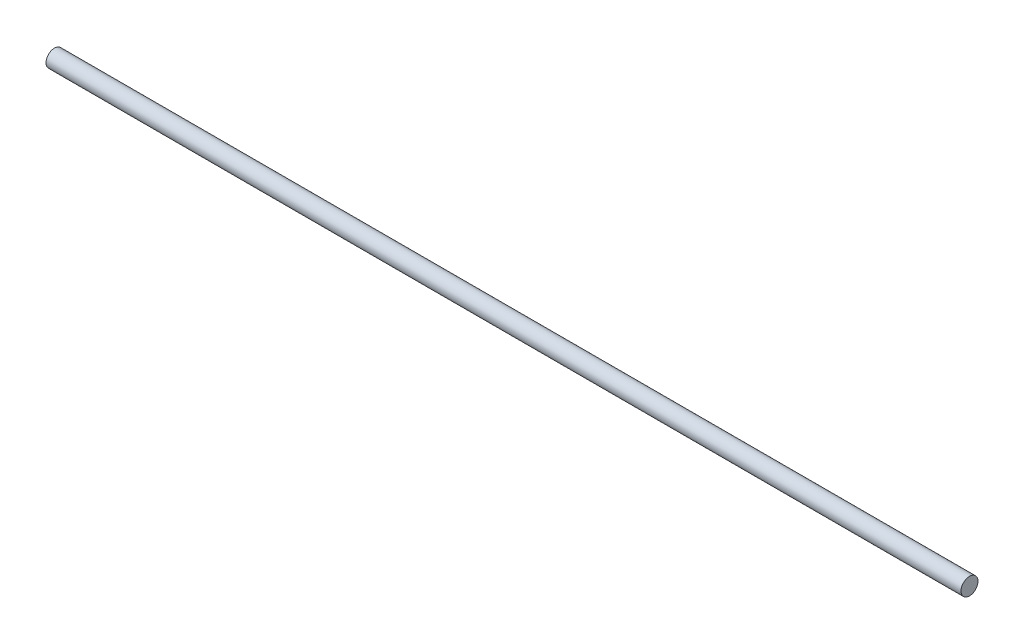
ISO-10303-21;
HEADER;
FILE_DESCRIPTION(('STEP AP214'),'2;1');
FILE_NAME('part.step','',(''),(''),'','','');
FILE_SCHEMA(('AUTOMOTIVE_DESIGN { 1 0 10303 214 1 1 1 1 }'));
ENDSEC;
DATA;
#1=APPLICATION_CONTEXT('core data for automotive mechanical design processes');
#2=APPLICATION_PROTOCOL_DEFINITION('international standard','automotive_design',2000,#1);
#3=PRODUCT_CONTEXT('',#1,'mechanical');
#4=PRODUCT('Part','Part','',(#3));
#5=PRODUCT_RELATED_PRODUCT_CATEGORY('part','',(#4));
#6=PRODUCT_DEFINITION_FORMATION('','',#4);
#7=PRODUCT_DEFINITION_CONTEXT('part definition',#1,'design');
#8=PRODUCT_DEFINITION('design','',#6,#7);
#9=PRODUCT_DEFINITION_SHAPE('','',#8);
#10=(LENGTH_UNIT() NAMED_UNIT(*) SI_UNIT(.MILLI.,.METRE.));
#11=(NAMED_UNIT(*) PLANE_ANGLE_UNIT() SI_UNIT($,.RADIAN.));
#12=(NAMED_UNIT(*) SI_UNIT($,.STERADIAN.) SOLID_ANGLE_UNIT());
#13=UNCERTAINTY_MEASURE_WITH_UNIT(LENGTH_MEASURE(1.E-05),#10,'distance_accuracy_value','');
#14=(GEOMETRIC_REPRESENTATION_CONTEXT(3) GLOBAL_UNCERTAINTY_ASSIGNED_CONTEXT((#13)) GLOBAL_UNIT_ASSIGNED_CONTEXT((#10,
#11,#12)) REPRESENTATION_CONTEXT('',''));
#15=CARTESIAN_POINT('',(0.,0.,0.));
#16=DIRECTION('',(0.,0.,1.));
#17=DIRECTION('',(1.,0.,0.));
#18=AXIS2_PLACEMENT_3D('',#15,#16,#17);
#19=CARTESIAN_POINT('',(683.514,0.,0.));
#20=DIRECTION('',(-1.,0.,0.));
#21=DIRECTION('',(0.,0.,1.));
#22=AXIS2_PLACEMENT_3D('',#19,#20,#21);
#23=CYLINDRICAL_SURFACE('',#22,6.35);
#24=CARTESIAN_POINT('',(683.514,0.,0.));
#25=DIRECTION('',(1.,0.,0.));
#26=DIRECTION('',(0.,0.,-1.));
#27=AXIS2_PLACEMENT_3D('',#24,#25,#26);
#28=CIRCLE('',#27,6.35);
#29=CARTESIAN_POINT('',(683.514,0.,-6.35));
#30=VERTEX_POINT('',#29);
#31=EDGE_CURVE('E10',#30,#30,#28,.T.);
#32=ORIENTED_EDGE('',*,*,#31,.F.);
#33=EDGE_LOOP('',(#32));
#34=FACE_BOUND('',#33,.T.);
#35=CARTESIAN_POINT('',(0.,0.,0.));
#36=DIRECTION('',(1.,0.,0.));
#37=DIRECTION('',(0.,0.,-1.));
#38=AXIS2_PLACEMENT_3D('',#35,#36,#37);
#39=CIRCLE('',#38,6.35);
#40=CARTESIAN_POINT('',(0.,0.,-6.35));
#41=VERTEX_POINT('',#40);
#42=EDGE_CURVE('E35',#41,#41,#39,.T.);
#43=ORIENTED_EDGE('',*,*,#42,.T.);
#44=EDGE_LOOP('',(#43));
#45=FACE_BOUND('',#44,.T.);
#46=ADVANCED_FACE('F32',(#34,#45),#23,.T.);
#47=CARTESIAN_POINT('',(683.514,0.,0.));
#48=DIRECTION('',(1.,0.,0.));
#49=DIRECTION('',(0.,0.,-1.));
#50=AXIS2_PLACEMENT_3D('',#47,#48,#49);
#51=PLANE('',#50);
#52=ORIENTED_EDGE('',*,*,#31,.T.);
#53=EDGE_LOOP('',(#52));
#54=FACE_BOUND('',#53,.T.);
#55=ADVANCED_FACE('F47',(#54),#51,.T.);
#56=CARTESIAN_POINT('',(0.,0.,0.));
#57=DIRECTION('',(1.,0.,0.));
#58=DIRECTION('',(0.,0.,-1.));
#59=AXIS2_PLACEMENT_3D('',#56,#57,#58);
#60=PLANE('',#59);
#61=ORIENTED_EDGE('',*,*,#42,.F.);
#62=EDGE_LOOP('',(#61));
#63=FACE_BOUND('',#62,.T.);
#64=ADVANCED_FACE('F45',(#63),#60,.F.);
#65=CLOSED_SHELL('',(#46,#55,#64));
#66=MANIFOLD_SOLID_BREP('B2',#65);
#67=ADVANCED_BREP_SHAPE_REPRESENTATION('',(#18,#66),#14);
#68=SHAPE_DEFINITION_REPRESENTATION(#9,#67);
ENDSEC;
END-ISO-10303-21;
